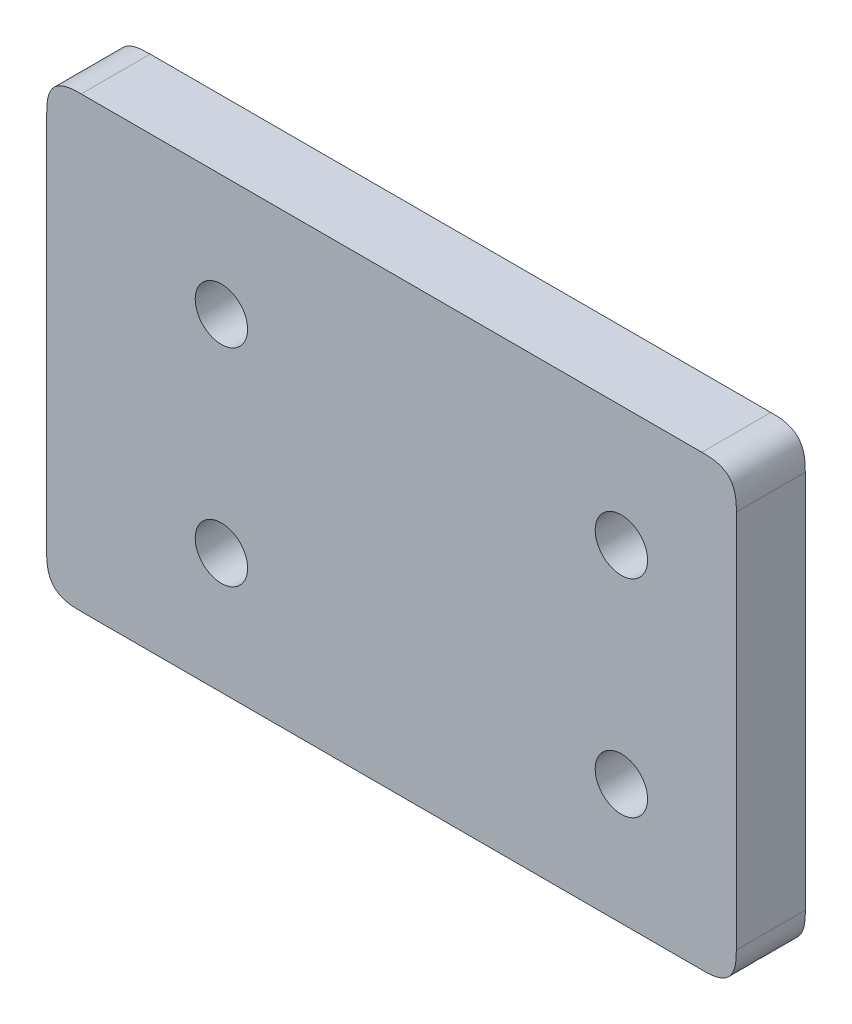
ISO-10303-21;
HEADER;
FILE_DESCRIPTION(('STEP AP214'),'2;1');
FILE_NAME('part.step','',(''),(''),'','','');
FILE_SCHEMA(('AUTOMOTIVE_DESIGN { 1 0 10303 214 1 1 1 1 }'));
ENDSEC;
DATA;
#1=APPLICATION_CONTEXT('core data for automotive mechanical design processes');
#2=APPLICATION_PROTOCOL_DEFINITION('international standard','automotive_design',2000,#1);
#3=PRODUCT_CONTEXT('',#1,'mechanical');
#4=PRODUCT('Part','Part','',(#3));
#5=PRODUCT_RELATED_PRODUCT_CATEGORY('part','',(#4));
#6=PRODUCT_DEFINITION_FORMATION('','',#4);
#7=PRODUCT_DEFINITION_CONTEXT('part definition',#1,'design');
#8=PRODUCT_DEFINITION('design','',#6,#7);
#9=PRODUCT_DEFINITION_SHAPE('','',#8);
#10=(LENGTH_UNIT() NAMED_UNIT(*) SI_UNIT(.MILLI.,.METRE.));
#11=(NAMED_UNIT(*) PLANE_ANGLE_UNIT() SI_UNIT($,.RADIAN.));
#12=(NAMED_UNIT(*) SI_UNIT($,.STERADIAN.) SOLID_ANGLE_UNIT());
#13=UNCERTAINTY_MEASURE_WITH_UNIT(LENGTH_MEASURE(1.E-05),#10,'distance_accuracy_value','');
#14=(GEOMETRIC_REPRESENTATION_CONTEXT(3) GLOBAL_UNCERTAINTY_ASSIGNED_CONTEXT((#13)) GLOBAL_UNIT_ASSIGNED_CONTEXT((#10,
#11,#12)) REPRESENTATION_CONTEXT('',''));
#15=CARTESIAN_POINT('',(0.,0.,0.));
#16=DIRECTION('',(0.,0.,1.));
#17=DIRECTION('',(1.,0.,0.));
#18=AXIS2_PLACEMENT_3D('',#15,#16,#17);
#19=CARTESIAN_POINT('',(12.7,3.175,6.35));
#20=DIRECTION('',(1.,0.,0.));
#21=DIRECTION('',(0.,1.,0.));
#22=AXIS2_PLACEMENT_3D('',#19,#20,#21);
#23=PLANE('',#22);
#24=DIRECTION('',(0.,-1.,0.));
#25=VECTOR('',#24,1.);
#26=CARTESIAN_POINT('',(12.7,3.175,0.));
#27=LINE('',#26,#25);
#28=CARTESIAN_POINT('',(12.7,41.275,0.));
#29=VERTEX_POINT('',#28);
#30=CARTESIAN_POINT('',(12.7,6.35,0.));
#31=VERTEX_POINT('',#30);
#32=EDGE_CURVE('E145',#29,#31,#27,.T.);
#33=ORIENTED_EDGE('',*,*,#32,.T.);
#34=CARTESIAN_POINT('',(12.7,6.35,6.6675));
#35=CARTESIAN_POINT('',(12.7,6.35,4.33916666666642));
#36=CARTESIAN_POINT('',(12.7,6.35,2.01083333333333));
#37=CARTESIAN_POINT('',(12.7,6.35,-0.317499999999999));
#38=B_SPLINE_CURVE_WITH_KNOTS('',3,(#34,#35,#36,#37),.UNSPECIFIED.,.F.,.F.,(4,4),(-0.0003175,
0.0066675),.UNSPECIFIED.);
#39=CARTESIAN_POINT('',(12.7,6.35,6.35));
#40=VERTEX_POINT('',#39);
#41=EDGE_CURVE('E116',#31,#40,#38,.F.);
#42=ORIENTED_EDGE('',*,*,#41,.T.);
#43=DIRECTION('',(0.,-1.,0.));
#44=VECTOR('',#43,1.);
#45=CARTESIAN_POINT('',(12.7,3.175,6.35));
#46=LINE('',#45,#44);
#47=CARTESIAN_POINT('',(12.7,41.275,6.35));
#48=VERTEX_POINT('',#47);
#49=EDGE_CURVE('E207',#48,#40,#46,.T.);
#50=ORIENTED_EDGE('',*,*,#49,.F.);
#51=CARTESIAN_POINT('',(12.7,41.275,-0.317499999999999));
#52=CARTESIAN_POINT('',(12.7,41.275,2.01083333333333));
#53=CARTESIAN_POINT('',(12.7,41.275,4.33916666666642));
#54=CARTESIAN_POINT('',(12.7,41.275,6.6675));
#55=B_SPLINE_CURVE_WITH_KNOTS('',3,(#51,#52,#53,#54),.UNSPECIFIED.,.F.,.F.,(4,4),(-0.0003175,
0.0066675),.UNSPECIFIED.);
#56=EDGE_CURVE('E123',#48,#29,#55,.F.);
#57=ORIENTED_EDGE('',*,*,#56,.T.);
#58=EDGE_LOOP('',(#33,#42,#50,#57));
#59=FACE_BOUND('',#58,.T.);
#60=ADVANCED_FACE('F34',(#59),#23,.F.);
#61=CARTESIAN_POINT('',(12.7,3.175,6.35));
#62=DIRECTION('',(0.,1.,0.));
#63=DIRECTION('',(-1.,0.,0.));
#64=AXIS2_PLACEMENT_3D('',#61,#62,#63);
#65=PLANE('',#64);
#66=DIRECTION('',(1.,0.,0.));
#67=VECTOR('',#66,1.);
#68=CARTESIAN_POINT('',(12.7,3.175,6.35));
#69=LINE('',#68,#67);
#70=CARTESIAN_POINT('',(15.875,3.175,6.35));
#71=VERTEX_POINT('',#70);
#72=CARTESIAN_POINT('',(73.025,3.175,6.35));
#73=VERTEX_POINT('',#72);
#74=EDGE_CURVE('E135',#71,#73,#69,.T.);
#75=ORIENTED_EDGE('',*,*,#74,.F.);
#76=CARTESIAN_POINT('',(15.875,3.175,-0.317499999999999));
#77=CARTESIAN_POINT('',(15.875,3.175,2.01083333333333));
#78=CARTESIAN_POINT('',(15.875,3.175,4.33916666666642));
#79=CARTESIAN_POINT('',(15.875,3.175,6.6675));
#80=B_SPLINE_CURVE_WITH_KNOTS('',3,(#76,#77,#78,#79),.UNSPECIFIED.,.F.,.F.,(4,4),(-0.0003175,
0.0066675),.UNSPECIFIED.);
#81=CARTESIAN_POINT('',(15.875,3.175,0.));
#82=VERTEX_POINT('',#81);
#83=EDGE_CURVE('E114',#71,#82,#80,.F.);
#84=ORIENTED_EDGE('',*,*,#83,.T.);
#85=DIRECTION('',(1.,0.,0.));
#86=VECTOR('',#85,1.);
#87=CARTESIAN_POINT('',(12.7,3.175,0.));
#88=LINE('',#87,#86);
#89=CARTESIAN_POINT('',(73.025,3.175,0.));
#90=VERTEX_POINT('',#89);
#91=EDGE_CURVE('E132',#82,#90,#88,.T.);
#92=ORIENTED_EDGE('',*,*,#91,.T.);
#93=CARTESIAN_POINT('',(73.025,3.175,6.6675));
#94=CARTESIAN_POINT('',(73.025,3.175,4.33916666666642));
#95=CARTESIAN_POINT('',(73.025,3.175,2.01083333333333));
#96=CARTESIAN_POINT('',(73.025,3.175,-0.317499999999999));
#97=B_SPLINE_CURVE_WITH_KNOTS('',3,(#93,#94,#95,#96),.UNSPECIFIED.,.F.,.F.,(4,4),(-0.0003175,
0.0066675),.UNSPECIFIED.);
#98=EDGE_CURVE('E137',#90,#73,#97,.F.);
#99=ORIENTED_EDGE('',*,*,#98,.T.);
#100=EDGE_LOOP('',(#75,#84,#92,#99));
#101=FACE_BOUND('',#100,.T.);
#102=ADVANCED_FACE('F131',(#101),#65,.F.);
#103=CARTESIAN_POINT('',(76.2,3.175,6.35));
#104=DIRECTION('',(-1.,0.,0.));
#105=DIRECTION('',(0.,0.,1.));
#106=AXIS2_PLACEMENT_3D('',#103,#104,#105);
#107=PLANE('',#106);
#108=DIRECTION('',(0.,1.,0.));
#109=VECTOR('',#108,1.);
#110=CARTESIAN_POINT('',(76.2,3.175,6.35));
#111=LINE('',#110,#109);
#112=CARTESIAN_POINT('',(76.2,6.35,6.35));
#113=VERTEX_POINT('',#112);
#114=CARTESIAN_POINT('',(76.2,41.275,6.35));
#115=VERTEX_POINT('',#114);
#116=EDGE_CURVE('E226',#113,#115,#111,.T.);
#117=ORIENTED_EDGE('',*,*,#116,.F.);
#118=CARTESIAN_POINT('',(76.2,6.35,-0.317499999999999));
#119=CARTESIAN_POINT('',(76.2,6.35,2.01083333333333));
#120=CARTESIAN_POINT('',(76.2,6.35,4.33916666666642));
#121=CARTESIAN_POINT('',(76.2,6.35,6.6675));
#122=B_SPLINE_CURVE_WITH_KNOTS('',3,(#118,#119,#120,#121),.UNSPECIFIED.,.F.,.F.,(4,4),
(-0.0003175,0.0066675),.UNSPECIFIED.);
#123=CARTESIAN_POINT('',(76.2,6.35,0.));
#124=VERTEX_POINT('',#123);
#125=EDGE_CURVE('E11',#113,#124,#122,.F.);
#126=ORIENTED_EDGE('',*,*,#125,.T.);
#127=DIRECTION('',(0.,1.,0.));
#128=VECTOR('',#127,1.);
#129=CARTESIAN_POINT('',(76.2,3.175,0.));
#130=LINE('',#129,#128);
#131=CARTESIAN_POINT('',(76.2,41.275,0.));
#132=VERTEX_POINT('',#131);
#133=EDGE_CURVE('E144',#124,#132,#130,.T.);
#134=ORIENTED_EDGE('',*,*,#133,.T.);
#135=CARTESIAN_POINT('',(76.2,41.275,6.6675));
#136=CARTESIAN_POINT('',(76.2,41.275,4.33916666666642));
#137=CARTESIAN_POINT('',(76.2,41.275,2.01083333333333));
#138=CARTESIAN_POINT('',(76.2,41.275,-0.317499999999999));
#139=B_SPLINE_CURVE_WITH_KNOTS('',3,(#135,#136,#137,#138),.UNSPECIFIED.,.F.,.F.,(4,4),
(-0.0003175,0.0066675),.UNSPECIFIED.);
#140=EDGE_CURVE('E48',#132,#115,#139,.F.);
#141=ORIENTED_EDGE('',*,*,#140,.T.);
#142=EDGE_LOOP('',(#117,#126,#134,#141));
#143=FACE_BOUND('',#142,.T.);
#144=ADVANCED_FACE('F303',(#143),#107,.F.);
#145=CARTESIAN_POINT('',(12.7,44.45,6.35));
#146=DIRECTION('',(0.,-1.,0.));
#147=DIRECTION('',(0.,0.,-1.));
#148=AXIS2_PLACEMENT_3D('',#145,#146,#147);
#149=PLANE('',#148);
#150=DIRECTION('',(-1.,0.,0.));
#151=VECTOR('',#150,1.);
#152=CARTESIAN_POINT('',(12.7,44.45,0.));
#153=LINE('',#152,#151);
#154=CARTESIAN_POINT('',(73.025,44.45,0.));
#155=VERTEX_POINT('',#154);
#156=CARTESIAN_POINT('',(15.875,44.45,0.));
#157=VERTEX_POINT('',#156);
#158=EDGE_CURVE('E148',#155,#157,#153,.T.);
#159=ORIENTED_EDGE('',*,*,#158,.T.);
#160=CARTESIAN_POINT('',(15.875,44.45,6.6675));
#161=CARTESIAN_POINT('',(15.875,44.45,4.33916666666642));
#162=CARTESIAN_POINT('',(15.875,44.45,2.01083333333333));
#163=CARTESIAN_POINT('',(15.875,44.45,-0.317499999999999));
#164=B_SPLINE_CURVE_WITH_KNOTS('',3,(#160,#161,#162,#163),.UNSPECIFIED.,.F.,.F.,(4,4),
(-0.0003175,0.0066675),.UNSPECIFIED.);
#165=CARTESIAN_POINT('',(15.875,44.45,6.35));
#166=VERTEX_POINT('',#165);
#167=EDGE_CURVE('E55',#157,#166,#164,.F.);
#168=ORIENTED_EDGE('',*,*,#167,.T.);
#169=DIRECTION('',(-1.,0.,0.));
#170=VECTOR('',#169,1.);
#171=CARTESIAN_POINT('',(12.7,44.45,6.35));
#172=LINE('',#171,#170);
#173=CARTESIAN_POINT('',(73.025,44.45,6.35));
#174=VERTEX_POINT('',#173);
#175=EDGE_CURVE('E229',#174,#166,#172,.T.);
#176=ORIENTED_EDGE('',*,*,#175,.F.);
#177=CARTESIAN_POINT('',(73.025,44.45,-0.317499999999999));
#178=CARTESIAN_POINT('',(73.025,44.45,2.01083333333333));
#179=CARTESIAN_POINT('',(73.025,44.45,4.33916666666642));
#180=CARTESIAN_POINT('',(73.025,44.45,6.6675));
#181=B_SPLINE_CURVE_WITH_KNOTS('',3,(#177,#178,#179,#180),.UNSPECIFIED.,.F.,.F.,(4,4),
(-0.0003175,0.0066675),.UNSPECIFIED.);
#182=EDGE_CURVE('E280',#174,#155,#181,.F.);
#183=ORIENTED_EDGE('',*,*,#182,.T.);
#184=EDGE_LOOP('',(#159,#168,#176,#183));
#185=FACE_BOUND('',#184,.T.);
#186=ADVANCED_FACE('F186',(#185),#149,.F.);
#187=CARTESIAN_POINT('',(0.,0.,6.35));
#188=DIRECTION('',(0.,0.,-1.));
#189=DIRECTION('',(-1.,0.,0.));
#190=AXIS2_PLACEMENT_3D('',#187,#188,#189);
#191=PLANE('',#190);
#192=CARTESIAN_POINT('',(65.6154755157234,14.2875000000021,6.35));
#193=DIRECTION('',(0.,0.,-1.));
#194=DIRECTION('',(-1.,0.,0.));
#195=AXIS2_PLACEMENT_3D('',#192,#193,#194);
#196=CIRCLE('',#195,2.41300000000007);
#197=CARTESIAN_POINT('',(63.2024755157233,14.2875000000021,6.35));
#198=VERTEX_POINT('',#197);
#199=EDGE_CURVE('E150',#198,#198,#196,.T.);
#200=ORIENTED_EDGE('',*,*,#199,.T.);
#201=EDGE_LOOP('',(#200));
#202=FACE_BOUND('',#201,.T.);
#203=CARTESIAN_POINT('',(28.7854755157234,14.287500000002,6.35));
#204=DIRECTION('',(0.,0.,-1.));
#205=DIRECTION('',(-1.,0.,0.));
#206=AXIS2_PLACEMENT_3D('',#203,#204,#205);
#207=CIRCLE('',#206,2.41300000000006);
#208=CARTESIAN_POINT('',(26.3724755157234,14.287500000002,6.35));
#209=VERTEX_POINT('',#208);
#210=EDGE_CURVE('E543',#209,#209,#207,.T.);
#211=ORIENTED_EDGE('',*,*,#210,.T.);
#212=EDGE_LOOP('',(#211));
#213=FACE_BOUND('',#212,.T.);
#214=CARTESIAN_POINT('',(28.7854755157234,33.337500000002,6.35));
#215=DIRECTION('',(0.,0.,-1.));
#216=DIRECTION('',(-1.,0.,0.));
#217=AXIS2_PLACEMENT_3D('',#214,#215,#216);
#218=CIRCLE('',#217,2.41300000000007);
#219=CARTESIAN_POINT('',(26.3724755157233,33.337500000002,6.35));
#220=VERTEX_POINT('',#219);
#221=EDGE_CURVE('E540',#220,#220,#218,.T.);
#222=ORIENTED_EDGE('',*,*,#221,.T.);
#223=EDGE_LOOP('',(#222));
#224=FACE_BOUND('',#223,.T.);
#225=CARTESIAN_POINT('',(65.6154755157234,33.3375000000021,6.35));
#226=DIRECTION('',(0.,0.,-1.));
#227=DIRECTION('',(-1.,0.,0.));
#228=AXIS2_PLACEMENT_3D('',#225,#226,#227);
#229=CIRCLE('',#228,2.41300000000007);
#230=CARTESIAN_POINT('',(63.2024755157233,33.3375000000021,6.35));
#231=VERTEX_POINT('',#230);
#232=EDGE_CURVE('E538',#231,#231,#229,.T.);
#233=ORIENTED_EDGE('',*,*,#232,.T.);
#234=EDGE_LOOP('',(#233));
#235=FACE_BOUND('',#234,.T.);
#236=ORIENTED_EDGE('',*,*,#49,.T.);
#237=CARTESIAN_POINT('',(15.875,3.175,6.35));
#238=CARTESIAN_POINT('',(15.3409711863797,3.175,6.35));
#239=CARTESIAN_POINT('',(14.8069423727594,3.175,6.35));
#240=CARTESIAN_POINT('',(13.6299359697327,3.40262184547957,6.35));
#241=CARTESIAN_POINT('',(12.9276218454796,4.10493596973271,6.35));
#242=CARTESIAN_POINT('',(12.7,5.28194237275944,6.35));
#243=CARTESIAN_POINT('',(12.7,5.81597118637972,6.35));
#244=CARTESIAN_POINT('',(12.7,6.35,6.35));
#245=B_SPLINE_CURVE_WITH_KNOTS('',5,(#237,#238,#239,#240,#241,#242,#243,#244),.UNSPECIFIED.,.F.,
.F.,(6,2,6),(0.,0.5,1.),.UNSPECIFIED.);
#246=EDGE_CURVE('E268',#40,#71,#245,.F.);
#247=ORIENTED_EDGE('',*,*,#246,.T.);
#248=ORIENTED_EDGE('',*,*,#74,.T.);
#249=CARTESIAN_POINT('',(76.2,6.35,6.35));
#250=CARTESIAN_POINT('',(76.2,5.81597118637972,6.35));
#251=CARTESIAN_POINT('',(76.2,5.28194237275944,6.35));
#252=CARTESIAN_POINT('',(75.9723781545204,4.10493596973271,6.35));
#253=CARTESIAN_POINT('',(75.2700640302673,3.40262184547956,6.35));
#254=CARTESIAN_POINT('',(74.0930576272406,3.175,6.35));
#255=CARTESIAN_POINT('',(73.5590288136203,3.175,6.35));
#256=CARTESIAN_POINT('',(73.025,3.175,6.35));
#257=B_SPLINE_CURVE_WITH_KNOTS('',5,(#249,#250,#251,#252,#253,#254,#255,#256),.UNSPECIFIED.,.F.,
.F.,(6,2,6),(0.,0.5,1.),.UNSPECIFIED.);
#258=EDGE_CURVE('E245',#73,#113,#257,.F.);
#259=ORIENTED_EDGE('',*,*,#258,.T.);
#260=ORIENTED_EDGE('',*,*,#116,.T.);
#261=CARTESIAN_POINT('',(73.025,44.45,6.35));
#262=CARTESIAN_POINT('',(73.5590288136203,44.45,6.35));
#263=CARTESIAN_POINT('',(74.0930576272406,44.45,6.35));
#264=CARTESIAN_POINT('',(75.2700640302673,44.2223781545204,6.35));
#265=CARTESIAN_POINT('',(75.9723781545204,43.5200640302673,6.35));
#266=CARTESIAN_POINT('',(76.2,42.3430576272406,6.35));
#267=CARTESIAN_POINT('',(76.2,41.8090288136203,6.35));
#268=CARTESIAN_POINT('',(76.2,41.275,6.35));
#269=B_SPLINE_CURVE_WITH_KNOTS('',5,(#261,#262,#263,#264,#265,#266,#267,#268),.UNSPECIFIED.,.F.,
.F.,(6,2,6),(0.,0.5,1.),.UNSPECIFIED.);
#270=EDGE_CURVE('E63',#115,#174,#269,.F.);
#271=ORIENTED_EDGE('',*,*,#270,.T.);
#272=ORIENTED_EDGE('',*,*,#175,.T.);
#273=CARTESIAN_POINT('',(12.7,41.275,6.35));
#274=CARTESIAN_POINT('',(12.7,41.8090288136203,6.35));
#275=CARTESIAN_POINT('',(12.7,42.3430576272406,6.35));
#276=CARTESIAN_POINT('',(12.9276218454796,43.5200640302673,6.35));
#277=CARTESIAN_POINT('',(13.6299359697327,44.2223781545204,6.35));
#278=CARTESIAN_POINT('',(14.8069423727594,44.45,6.35));
#279=CARTESIAN_POINT('',(15.3409711863797,44.45,6.35));
#280=CARTESIAN_POINT('',(15.875,44.45,6.35));
#281=B_SPLINE_CURVE_WITH_KNOTS('',5,(#273,#274,#275,#276,#277,#278,#279,#280),.UNSPECIFIED.,.F.,
.F.,(6,2,6),(0.,0.5,1.),.UNSPECIFIED.);
#282=EDGE_CURVE('E257',#166,#48,#281,.F.);
#283=ORIENTED_EDGE('',*,*,#282,.T.);
#284=EDGE_LOOP('',(#236,#247,#248,#259,#260,#271,#272,#283));
#285=FACE_BOUND('',#284,.T.);
#286=ADVANCED_FACE('F182',(#202,#213,#224,#235,#285),#191,.F.);
#287=CARTESIAN_POINT('',(0.,0.,0.));
#288=DIRECTION('',(0.,0.,-1.));
#289=DIRECTION('',(-1.,0.,0.));
#290=AXIS2_PLACEMENT_3D('',#287,#288,#289);
#291=PLANE('',#290);
#292=CARTESIAN_POINT('',(65.6154755157234,14.2875000000021,0.));
#293=DIRECTION('',(0.,0.,1.));
#294=DIRECTION('',(1.,0.,0.));
#295=AXIS2_PLACEMENT_3D('',#292,#293,#294);
#296=CIRCLE('',#295,2.41300000000007);
#297=CARTESIAN_POINT('',(68.0284755157235,14.2875000000021,0.));
#298=VERTEX_POINT('',#297);
#299=EDGE_CURVE('E634',#298,#298,#296,.T.);
#300=ORIENTED_EDGE('',*,*,#299,.T.);
#301=EDGE_LOOP('',(#300));
#302=FACE_BOUND('',#301,.T.);
#303=CARTESIAN_POINT('',(28.7854755157234,14.287500000002,0.));
#304=DIRECTION('',(0.,0.,1.));
#305=DIRECTION('',(1.,0.,0.));
#306=AXIS2_PLACEMENT_3D('',#303,#304,#305);
#307=CIRCLE('',#306,2.41300000000006);
#308=CARTESIAN_POINT('',(31.1984755157235,14.287500000002,0.));
#309=VERTEX_POINT('',#308);
#310=EDGE_CURVE('E637',#309,#309,#307,.T.);
#311=ORIENTED_EDGE('',*,*,#310,.T.);
#312=EDGE_LOOP('',(#311));
#313=FACE_BOUND('',#312,.T.);
#314=CARTESIAN_POINT('',(28.7854755157234,33.337500000002,0.));
#315=DIRECTION('',(0.,0.,1.));
#316=DIRECTION('',(1.,0.,0.));
#317=AXIS2_PLACEMENT_3D('',#314,#315,#316);
#318=CIRCLE('',#317,2.41300000000007);
#319=CARTESIAN_POINT('',(31.1984755157235,33.337500000002,0.));
#320=VERTEX_POINT('',#319);
#321=EDGE_CURVE('E545',#320,#320,#318,.T.);
#322=ORIENTED_EDGE('',*,*,#321,.T.);
#323=EDGE_LOOP('',(#322));
#324=FACE_BOUND('',#323,.T.);
#325=CARTESIAN_POINT('',(65.6154755157234,33.3375000000021,0.));
#326=DIRECTION('',(0.,0.,1.));
#327=DIRECTION('',(1.,0.,0.));
#328=AXIS2_PLACEMENT_3D('',#325,#326,#327);
#329=CIRCLE('',#328,2.41300000000007);
#330=CARTESIAN_POINT('',(68.0284755157235,33.3375000000021,0.));
#331=VERTEX_POINT('',#330);
#332=EDGE_CURVE('E535',#331,#331,#329,.T.);
#333=ORIENTED_EDGE('',*,*,#332,.T.);
#334=EDGE_LOOP('',(#333));
#335=FACE_BOUND('',#334,.T.);
#336=ORIENTED_EDGE('',*,*,#91,.F.);
#337=CARTESIAN_POINT('',(12.7,6.35,0.));
#338=CARTESIAN_POINT('',(12.7,5.81597118637972,0.));
#339=CARTESIAN_POINT('',(12.7,5.28194237275944,0.));
#340=CARTESIAN_POINT('',(12.9276218454796,4.10493596973271,0.));
#341=CARTESIAN_POINT('',(13.6299359697327,3.40262184547956,0.));
#342=CARTESIAN_POINT('',(14.8069423727594,3.175,0.));
#343=CARTESIAN_POINT('',(15.3409711863797,3.175,0.));
#344=CARTESIAN_POINT('',(15.875,3.175,0.));
#345=B_SPLINE_CURVE_WITH_KNOTS('',5,(#337,#338,#339,#340,#341,#342,#343,#344),.UNSPECIFIED.,.F.,
.F.,(6,2,6),(0.,0.5,1.),.UNSPECIFIED.);
#346=EDGE_CURVE('E109',#82,#31,#345,.F.);
#347=ORIENTED_EDGE('',*,*,#346,.T.);
#348=ORIENTED_EDGE('',*,*,#32,.F.);
#349=CARTESIAN_POINT('',(15.875,44.45,0.));
#350=CARTESIAN_POINT('',(15.3409711863797,44.45,0.));
#351=CARTESIAN_POINT('',(14.8069423727594,44.45,0.));
#352=CARTESIAN_POINT('',(13.6299359697327,44.2223781545204,0.));
#353=CARTESIAN_POINT('',(12.9276218454796,43.5200640302673,0.));
#354=CARTESIAN_POINT('',(12.7,42.3430576272406,0.));
#355=CARTESIAN_POINT('',(12.7,41.8090288136203,0.));
#356=CARTESIAN_POINT('',(12.7,41.275,0.));
#357=B_SPLINE_CURVE_WITH_KNOTS('',5,(#349,#350,#351,#352,#353,#354,#355,#356),.UNSPECIFIED.,.F.,
.F.,(6,2,6),(0.,0.5,1.),.UNSPECIFIED.);
#358=EDGE_CURVE('E124',#29,#157,#357,.F.);
#359=ORIENTED_EDGE('',*,*,#358,.T.);
#360=ORIENTED_EDGE('',*,*,#158,.F.);
#361=CARTESIAN_POINT('',(76.2,41.275,0.));
#362=CARTESIAN_POINT('',(76.2,41.8090288136203,0.));
#363=CARTESIAN_POINT('',(76.2,42.3430576272406,0.));
#364=CARTESIAN_POINT('',(75.9723781545204,43.5200640302673,0.));
#365=CARTESIAN_POINT('',(75.2700640302673,44.2223781545204,0.));
#366=CARTESIAN_POINT('',(74.0930576272406,44.45,0.));
#367=CARTESIAN_POINT('',(73.5590288136203,44.45,0.));
#368=CARTESIAN_POINT('',(73.025,44.45,0.));
#369=B_SPLINE_CURVE_WITH_KNOTS('',5,(#361,#362,#363,#364,#365,#366,#367,#368),.UNSPECIFIED.,.F.,
.F.,(6,2,6),(0.,0.5,1.),.UNSPECIFIED.);
#370=EDGE_CURVE('E136',#155,#132,#369,.F.);
#371=ORIENTED_EDGE('',*,*,#370,.T.);
#372=ORIENTED_EDGE('',*,*,#133,.F.);
#373=CARTESIAN_POINT('',(73.025,3.175,0.));
#374=CARTESIAN_POINT('',(73.5590288136203,3.175,0.));
#375=CARTESIAN_POINT('',(74.0930576272406,3.175,0.));
#376=CARTESIAN_POINT('',(75.2700640302673,3.40262184547956,0.));
#377=CARTESIAN_POINT('',(75.9723781545204,4.10493596973271,0.));
#378=CARTESIAN_POINT('',(76.2,5.28194237275944,0.));
#379=CARTESIAN_POINT('',(76.2,5.81597118637972,0.));
#380=CARTESIAN_POINT('',(76.2,6.35,0.));
#381=B_SPLINE_CURVE_WITH_KNOTS('',5,(#373,#374,#375,#376,#377,#378,#379,#380),.UNSPECIFIED.,.F.,
.F.,(6,2,6),(0.,0.5,1.),.UNSPECIFIED.);
#382=EDGE_CURVE('E142',#124,#90,#381,.F.);
#383=ORIENTED_EDGE('',*,*,#382,.T.);
#384=EDGE_LOOP('',(#336,#347,#348,#359,#360,#371,#372,#383));
#385=FACE_BOUND('',#384,.T.);
#386=ADVANCED_FACE('F140',(#302,#313,#324,#335,#385),#291,.T.);
#387=CARTESIAN_POINT('',(65.6154755157234,33.3375000000021,0.));
#388=DIRECTION('',(0.,0.,1.));
#389=DIRECTION('',(1.,0.,0.));
#390=AXIS2_PLACEMENT_3D('',#387,#388,#389);
#391=CYLINDRICAL_SURFACE('',#390,2.41300000000007);
#392=ORIENTED_EDGE('',*,*,#332,.F.);
#393=EDGE_LOOP('',(#392));
#394=FACE_BOUND('',#393,.T.);
#395=ORIENTED_EDGE('',*,*,#232,.F.);
#396=EDGE_LOOP('',(#395));
#397=FACE_BOUND('',#396,.T.);
#398=ADVANCED_FACE('F181',(#394,#397),#391,.F.);
#399=CARTESIAN_POINT('',(28.7854755157234,33.337500000002,0.));
#400=DIRECTION('',(0.,0.,1.));
#401=DIRECTION('',(1.,0.,0.));
#402=AXIS2_PLACEMENT_3D('',#399,#400,#401);
#403=CYLINDRICAL_SURFACE('',#402,2.41300000000007);
#404=ORIENTED_EDGE('',*,*,#321,.F.);
#405=EDGE_LOOP('',(#404));
#406=FACE_BOUND('',#405,.T.);
#407=ORIENTED_EDGE('',*,*,#221,.F.);
#408=EDGE_LOOP('',(#407));
#409=FACE_BOUND('',#408,.T.);
#410=ADVANCED_FACE('F520',(#406,#409),#403,.F.);
#411=CARTESIAN_POINT('',(28.7854755157234,14.287500000002,0.));
#412=DIRECTION('',(0.,0.,1.));
#413=DIRECTION('',(1.,0.,0.));
#414=AXIS2_PLACEMENT_3D('',#411,#412,#413);
#415=CYLINDRICAL_SURFACE('',#414,2.41300000000006);
#416=ORIENTED_EDGE('',*,*,#310,.F.);
#417=EDGE_LOOP('',(#416));
#418=FACE_BOUND('',#417,.T.);
#419=ORIENTED_EDGE('',*,*,#210,.F.);
#420=EDGE_LOOP('',(#419));
#421=FACE_BOUND('',#420,.T.);
#422=ADVANCED_FACE('F514',(#418,#421),#415,.F.);
#423=CARTESIAN_POINT('',(65.6154755157234,14.2875000000021,0.));
#424=DIRECTION('',(0.,0.,1.));
#425=DIRECTION('',(1.,0.,0.));
#426=AXIS2_PLACEMENT_3D('',#423,#424,#425);
#427=CYLINDRICAL_SURFACE('',#426,2.41300000000007);
#428=ORIENTED_EDGE('',*,*,#299,.F.);
#429=EDGE_LOOP('',(#428));
#430=FACE_BOUND('',#429,.T.);
#431=ORIENTED_EDGE('',*,*,#199,.F.);
#432=EDGE_LOOP('',(#431));
#433=FACE_BOUND('',#432,.T.);
#434=ADVANCED_FACE('F478',(#430,#433),#427,.F.);
#435=CARTESIAN_POINT('',(15.875,3.175,6.6675));
#436=CARTESIAN_POINT('',(15.875,3.175,4.33916666666642));
#437=CARTESIAN_POINT('',(15.875,3.175,2.01083333333333));
#438=CARTESIAN_POINT('',(15.875,3.175,-0.317499999999999));
#439=CARTESIAN_POINT('',(15.3409711863797,3.175,6.6675));
#440=CARTESIAN_POINT('',(15.3409711863797,3.175,4.33916666666642));
#441=CARTESIAN_POINT('',(15.3409711863797,3.175,2.01083333333333));
#442=CARTESIAN_POINT('',(15.3409711863797,3.175,-0.317499999999999));
#443=CARTESIAN_POINT('',(14.8069423727594,3.175,6.6675));
#444=CARTESIAN_POINT('',(14.8069423727594,3.175,4.33916666666642));
#445=CARTESIAN_POINT('',(14.8069423727594,3.175,2.01083333333333));
#446=CARTESIAN_POINT('',(14.8069423727594,3.175,-0.317499999999999));
#447=CARTESIAN_POINT('',(13.6299359697327,3.40262184547956,6.6675));
#448=CARTESIAN_POINT('',(13.6299359697327,3.40262184547956,4.33916666666642));
#449=CARTESIAN_POINT('',(13.6299359697327,3.40262184547956,2.01083333333333));
#450=CARTESIAN_POINT('',(13.6299359697327,3.40262184547956,-0.317499999999999));
#451=CARTESIAN_POINT('',(12.9276218454796,4.10493596973271,6.6675));
#452=CARTESIAN_POINT('',(12.9276218454796,4.10493596973271,4.33916666666642));
#453=CARTESIAN_POINT('',(12.9276218454796,4.10493596973271,2.01083333333333));
#454=CARTESIAN_POINT('',(12.9276218454796,4.10493596973271,-0.317499999999999));
#455=CARTESIAN_POINT('',(12.7,5.28194237275944,6.6675));
#456=CARTESIAN_POINT('',(12.7,5.28194237275944,4.33916666666642));
#457=CARTESIAN_POINT('',(12.7,5.28194237275944,2.01083333333333));
#458=CARTESIAN_POINT('',(12.7,5.28194237275944,-0.317499999999999));
#459=CARTESIAN_POINT('',(12.7,5.81597118637972,6.6675));
#460=CARTESIAN_POINT('',(12.7,5.81597118637972,4.33916666666642));
#461=CARTESIAN_POINT('',(12.7,5.81597118637972,2.01083333333333));
#462=CARTESIAN_POINT('',(12.7,5.81597118637972,-0.317499999999999));
#463=CARTESIAN_POINT('',(12.7,6.35,6.6675));
#464=CARTESIAN_POINT('',(12.7,6.35,4.33916666666642));
#465=CARTESIAN_POINT('',(12.7,6.35,2.01083333333333));
#466=CARTESIAN_POINT('',(12.7,6.35,-0.317499999999999));
#467=B_SPLINE_SURFACE_WITH_KNOTS('',5,3,((#435,#436,#437,#438),(#439,#440,#441,#442),(#443,#444,
#445,#446),(#447,#448,#449,#450),(#451,#452,#453,#454),(#455,#456,#457,#458),(#459,#460,#461,
#462),(#463,#464,#465,#466)),.UNSPECIFIED.,.F.,.F.,.F.,(6,2,6),(4,4),(0.,0.5,1.),(-0.0003175,
0.0066675),.UNSPECIFIED.);
#468=ORIENTED_EDGE('',*,*,#246,.F.);
#469=ORIENTED_EDGE('',*,*,#41,.F.);
#470=ORIENTED_EDGE('',*,*,#346,.F.);
#471=ORIENTED_EDGE('',*,*,#83,.F.);
#472=EDGE_LOOP('',(#468,#469,#470,#471));
#473=FACE_BOUND('',#472,.T.);
#474=ADVANCED_FACE('F113',(#473),#467,.T.);
#475=CARTESIAN_POINT('',(12.7,41.275,6.6675));
#476=CARTESIAN_POINT('',(12.7,41.275,4.33916666666642));
#477=CARTESIAN_POINT('',(12.7,41.275,2.01083333333333));
#478=CARTESIAN_POINT('',(12.7,41.275,-0.317499999999999));
#479=CARTESIAN_POINT('',(12.7,41.8090288136203,6.6675));
#480=CARTESIAN_POINT('',(12.7,41.8090288136203,4.33916666666642));
#481=CARTESIAN_POINT('',(12.7,41.8090288136203,2.01083333333333));
#482=CARTESIAN_POINT('',(12.7,41.8090288136203,-0.317499999999999));
#483=CARTESIAN_POINT('',(12.7,42.3430576272406,6.6675));
#484=CARTESIAN_POINT('',(12.7,42.3430576272406,4.33916666666642));
#485=CARTESIAN_POINT('',(12.7,42.3430576272406,2.01083333333333));
#486=CARTESIAN_POINT('',(12.7,42.3430576272406,-0.317499999999999));
#487=CARTESIAN_POINT('',(12.9276218454796,43.5200640302673,6.6675));
#488=CARTESIAN_POINT('',(12.9276218454796,43.5200640302673,4.33916666666642));
#489=CARTESIAN_POINT('',(12.9276218454796,43.5200640302673,2.01083333333333));
#490=CARTESIAN_POINT('',(12.9276218454796,43.5200640302673,-0.317499999999999));
#491=CARTESIAN_POINT('',(13.6299359697327,44.2223781545204,6.6675));
#492=CARTESIAN_POINT('',(13.6299359697327,44.2223781545204,4.33916666666642));
#493=CARTESIAN_POINT('',(13.6299359697327,44.2223781545204,2.01083333333333));
#494=CARTESIAN_POINT('',(13.6299359697327,44.2223781545204,-0.317499999999999));
#495=CARTESIAN_POINT('',(14.8069423727594,44.45,6.6675));
#496=CARTESIAN_POINT('',(14.8069423727594,44.45,4.33916666666642));
#497=CARTESIAN_POINT('',(14.8069423727594,44.45,2.01083333333333));
#498=CARTESIAN_POINT('',(14.8069423727594,44.45,-0.317499999999999));
#499=CARTESIAN_POINT('',(15.3409711863797,44.45,6.6675));
#500=CARTESIAN_POINT('',(15.3409711863797,44.45,4.33916666666642));
#501=CARTESIAN_POINT('',(15.3409711863797,44.45,2.01083333333333));
#502=CARTESIAN_POINT('',(15.3409711863797,44.45,-0.317499999999999));
#503=CARTESIAN_POINT('',(15.875,44.45,6.6675));
#504=CARTESIAN_POINT('',(15.875,44.45,4.33916666666642));
#505=CARTESIAN_POINT('',(15.875,44.45,2.01083333333333));
#506=CARTESIAN_POINT('',(15.875,44.45,-0.317499999999999));
#507=B_SPLINE_SURFACE_WITH_KNOTS('',5,3,((#475,#476,#477,#478),(#479,#480,#481,#482),(#483,#484,
#485,#486),(#487,#488,#489,#490),(#491,#492,#493,#494),(#495,#496,#497,#498),(#499,#500,#501,
#502),(#503,#504,#505,#506)),.UNSPECIFIED.,.F.,.F.,.F.,(6,2,6),(4,4),(0.,0.5,1.),(-0.0003175,
0.0066675),.UNSPECIFIED.);
#508=ORIENTED_EDGE('',*,*,#282,.F.);
#509=ORIENTED_EDGE('',*,*,#167,.F.);
#510=ORIENTED_EDGE('',*,*,#358,.F.);
#511=ORIENTED_EDGE('',*,*,#56,.F.);
#512=EDGE_LOOP('',(#508,#509,#510,#511));
#513=FACE_BOUND('',#512,.T.);
#514=ADVANCED_FACE('F366',(#513),#507,.T.);
#515=CARTESIAN_POINT('',(76.2,6.35,6.6675));
#516=CARTESIAN_POINT('',(76.2,6.35,4.33916666666642));
#517=CARTESIAN_POINT('',(76.2,6.35,2.01083333333333));
#518=CARTESIAN_POINT('',(76.2,6.35,-0.317499999999999));
#519=CARTESIAN_POINT('',(76.2,5.81597118637972,6.6675));
#520=CARTESIAN_POINT('',(76.2,5.81597118637972,4.33916666666642));
#521=CARTESIAN_POINT('',(76.2,5.81597118637972,2.01083333333333));
#522=CARTESIAN_POINT('',(76.2,5.81597118637972,-0.317499999999999));
#523=CARTESIAN_POINT('',(76.2,5.28194237275944,6.6675));
#524=CARTESIAN_POINT('',(76.2,5.28194237275944,4.33916666666642));
#525=CARTESIAN_POINT('',(76.2,5.28194237275944,2.01083333333333));
#526=CARTESIAN_POINT('',(76.2,5.28194237275944,-0.317499999999999));
#527=CARTESIAN_POINT('',(75.9723781545204,4.10493596973271,6.6675));
#528=CARTESIAN_POINT('',(75.9723781545204,4.10493596973271,4.33916666666642));
#529=CARTESIAN_POINT('',(75.9723781545204,4.10493596973271,2.01083333333333));
#530=CARTESIAN_POINT('',(75.9723781545204,4.10493596973271,-0.317499999999999));
#531=CARTESIAN_POINT('',(75.2700640302673,3.40262184547956,6.6675));
#532=CARTESIAN_POINT('',(75.2700640302673,3.40262184547956,4.33916666666642));
#533=CARTESIAN_POINT('',(75.2700640302673,3.40262184547956,2.01083333333333));
#534=CARTESIAN_POINT('',(75.2700640302673,3.40262184547956,-0.317499999999999));
#535=CARTESIAN_POINT('',(74.0930576272406,3.175,6.6675));
#536=CARTESIAN_POINT('',(74.0930576272406,3.175,4.33916666666642));
#537=CARTESIAN_POINT('',(74.0930576272406,3.175,2.01083333333333));
#538=CARTESIAN_POINT('',(74.0930576272406,3.175,-0.317499999999999));
#539=CARTESIAN_POINT('',(73.5590288136203,3.175,6.6675));
#540=CARTESIAN_POINT('',(73.5590288136203,3.175,4.33916666666642));
#541=CARTESIAN_POINT('',(73.5590288136203,3.175,2.01083333333333));
#542=CARTESIAN_POINT('',(73.5590288136203,3.175,-0.317499999999999));
#543=CARTESIAN_POINT('',(73.025,3.175,6.6675));
#544=CARTESIAN_POINT('',(73.025,3.175,4.33916666666642));
#545=CARTESIAN_POINT('',(73.025,3.175,2.01083333333333));
#546=CARTESIAN_POINT('',(73.025,3.175,-0.317499999999999));
#547=B_SPLINE_SURFACE_WITH_KNOTS('',5,3,((#515,#516,#517,#518),(#519,#520,#521,#522),(#523,#524,
#525,#526),(#527,#528,#529,#530),(#531,#532,#533,#534),(#535,#536,#537,#538),(#539,#540,#541,
#542),(#543,#544,#545,#546)),.UNSPECIFIED.,.F.,.F.,.F.,(6,2,6),(4,4),(0.,0.5,1.),(-0.0003175,
0.0066675),.UNSPECIFIED.);
#548=ORIENTED_EDGE('',*,*,#258,.F.);
#549=ORIENTED_EDGE('',*,*,#98,.F.);
#550=ORIENTED_EDGE('',*,*,#382,.F.);
#551=ORIENTED_EDGE('',*,*,#125,.F.);
#552=EDGE_LOOP('',(#548,#549,#550,#551));
#553=FACE_BOUND('',#552,.T.);
#554=ADVANCED_FACE('F343',(#553),#547,.T.);
#555=CARTESIAN_POINT('',(73.025,44.45,6.6675));
#556=CARTESIAN_POINT('',(73.025,44.45,4.33916666666642));
#557=CARTESIAN_POINT('',(73.025,44.45,2.01083333333333));
#558=CARTESIAN_POINT('',(73.025,44.45,-0.317499999999999));
#559=CARTESIAN_POINT('',(73.5590288136203,44.45,6.6675));
#560=CARTESIAN_POINT('',(73.5590288136203,44.45,4.33916666666642));
#561=CARTESIAN_POINT('',(73.5590288136203,44.45,2.01083333333333));
#562=CARTESIAN_POINT('',(73.5590288136203,44.45,-0.317499999999999));
#563=CARTESIAN_POINT('',(74.0930576272406,44.45,6.6675));
#564=CARTESIAN_POINT('',(74.0930576272406,44.45,4.33916666666642));
#565=CARTESIAN_POINT('',(74.0930576272406,44.45,2.01083333333333));
#566=CARTESIAN_POINT('',(74.0930576272406,44.45,-0.317499999999999));
#567=CARTESIAN_POINT('',(75.2700640302673,44.2223781545204,6.6675));
#568=CARTESIAN_POINT('',(75.2700640302673,44.2223781545204,4.33916666666642));
#569=CARTESIAN_POINT('',(75.2700640302673,44.2223781545204,2.01083333333333));
#570=CARTESIAN_POINT('',(75.2700640302673,44.2223781545204,-0.317499999999999));
#571=CARTESIAN_POINT('',(75.9723781545204,43.5200640302673,6.6675));
#572=CARTESIAN_POINT('',(75.9723781545204,43.5200640302673,4.33916666666642));
#573=CARTESIAN_POINT('',(75.9723781545204,43.5200640302673,2.01083333333333));
#574=CARTESIAN_POINT('',(75.9723781545204,43.5200640302673,-0.317499999999999));
#575=CARTESIAN_POINT('',(76.2,42.3430576272406,6.6675));
#576=CARTESIAN_POINT('',(76.2,42.3430576272406,4.33916666666642));
#577=CARTESIAN_POINT('',(76.2,42.3430576272406,2.01083333333333));
#578=CARTESIAN_POINT('',(76.2,42.3430576272406,-0.317499999999999));
#579=CARTESIAN_POINT('',(76.2,41.8090288136203,6.6675));
#580=CARTESIAN_POINT('',(76.2,41.8090288136203,4.33916666666642));
#581=CARTESIAN_POINT('',(76.2,41.8090288136203,2.01083333333333));
#582=CARTESIAN_POINT('',(76.2,41.8090288136203,-0.317499999999999));
#583=CARTESIAN_POINT('',(76.2,41.275,6.6675));
#584=CARTESIAN_POINT('',(76.2,41.275,4.33916666666642));
#585=CARTESIAN_POINT('',(76.2,41.275,2.01083333333333));
#586=CARTESIAN_POINT('',(76.2,41.275,-0.317499999999999));
#587=B_SPLINE_SURFACE_WITH_KNOTS('',5,3,((#555,#556,#557,#558),(#559,#560,#561,#562),(#563,#564,
#565,#566),(#567,#568,#569,#570),(#571,#572,#573,#574),(#575,#576,#577,#578),(#579,#580,#581,
#582),(#583,#584,#585,#586)),.UNSPECIFIED.,.F.,.F.,.F.,(6,2,6),(4,4),(0.,0.5,1.),(-0.0003175,
0.0066675),.UNSPECIFIED.);
#588=ORIENTED_EDGE('',*,*,#270,.F.);
#589=ORIENTED_EDGE('',*,*,#140,.F.);
#590=ORIENTED_EDGE('',*,*,#370,.F.);
#591=ORIENTED_EDGE('',*,*,#182,.F.);
#592=EDGE_LOOP('',(#588,#589,#590,#591));
#593=FACE_BOUND('',#592,.T.);
#594=ADVANCED_FACE('F37',(#593),#587,.T.);
#595=CLOSED_SHELL('',(#60,#102,#144,#186,#286,#386,#398,#410,#422,#434,#474,#514,#554,#594));
#596=MANIFOLD_SOLID_BREP('B2',#595);
#597=ADVANCED_BREP_SHAPE_REPRESENTATION('',(#18,#596),#14);
#598=SHAPE_DEFINITION_REPRESENTATION(#9,#597);
ENDSEC;
END-ISO-10303-21;
